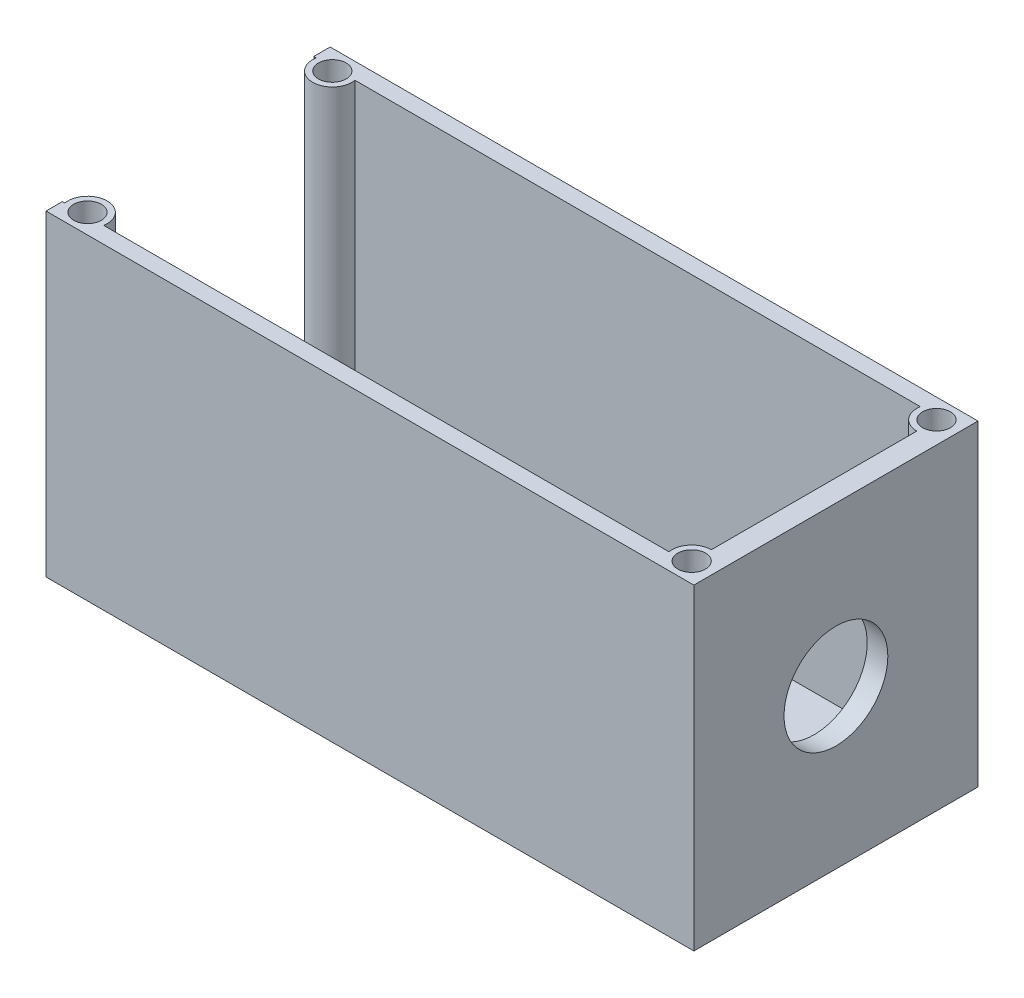
ISO-10303-21;
HEADER;
FILE_DESCRIPTION(('STEP AP214'),'2;1');
FILE_NAME('part.step','',(''),(''),'','','');
FILE_SCHEMA(('AUTOMOTIVE_DESIGN { 1 0 10303 214 1 1 1 1 }'));
ENDSEC;
DATA;
#1=APPLICATION_CONTEXT('core data for automotive mechanical design processes');
#2=APPLICATION_PROTOCOL_DEFINITION('international standard','automotive_design',2000,#1);
#3=PRODUCT_CONTEXT('',#1,'mechanical');
#4=PRODUCT('Part','Part','',(#3));
#5=PRODUCT_RELATED_PRODUCT_CATEGORY('part','',(#4));
#6=PRODUCT_DEFINITION_FORMATION('','',#4);
#7=PRODUCT_DEFINITION_CONTEXT('part definition',#1,'design');
#8=PRODUCT_DEFINITION('design','',#6,#7);
#9=PRODUCT_DEFINITION_SHAPE('','',#8);
#10=(LENGTH_UNIT() NAMED_UNIT(*) SI_UNIT(.MILLI.,.METRE.));
#11=(NAMED_UNIT(*) PLANE_ANGLE_UNIT() SI_UNIT($,.RADIAN.));
#12=(NAMED_UNIT(*) SI_UNIT($,.STERADIAN.) SOLID_ANGLE_UNIT());
#13=UNCERTAINTY_MEASURE_WITH_UNIT(LENGTH_MEASURE(1.E-05),#10,'distance_accuracy_value','');
#14=(GEOMETRIC_REPRESENTATION_CONTEXT(3) GLOBAL_UNCERTAINTY_ASSIGNED_CONTEXT((#13)) GLOBAL_UNIT_ASSIGNED_CONTEXT((#10,
#11,#12)) REPRESENTATION_CONTEXT('',''));
#15=CARTESIAN_POINT('',(0.,0.,0.));
#16=DIRECTION('',(0.,0.,1.));
#17=DIRECTION('',(1.,0.,0.));
#18=AXIS2_PLACEMENT_3D('',#15,#16,#17);
#19=CARTESIAN_POINT('',(57.28,-61.7251844873711,-24.5));
#20=DIRECTION('',(0.,0.,-1.));
#21=DIRECTION('',(-1.,0.,0.));
#22=AXIS2_PLACEMENT_3D('',#19,#20,#21);
#23=PLANE('',#22);
#24=DIRECTION('',(1.,0.,0.));
#25=VECTOR('',#24,1.);
#26=CARTESIAN_POINT('',(57.28,1.5,-24.5));
#27=LINE('',#26,#25);
#28=CARTESIAN_POINT('',(0.,1.5,-24.5));
#29=VERTEX_POINT('',#28);
#30=CARTESIAN_POINT('',(0.225176065070101,1.5,-24.5));
#31=VERTEX_POINT('',#30);
#32=EDGE_CURVE('E146',#29,#31,#27,.T.);
#33=ORIENTED_EDGE('',*,*,#32,.T.);
#34=DIRECTION('',(0.,1.,0.));
#35=VECTOR('',#34,1.);
#36=CARTESIAN_POINT('',(0.225176065070101,-3.59116882454314,-24.5));
#37=LINE('',#36,#35);
#38=CARTESIAN_POINT('',(0.225176065070101,29.,-24.5));
#39=VERTEX_POINT('',#38);
#40=EDGE_CURVE('E52',#31,#39,#37,.T.);
#41=ORIENTED_EDGE('',*,*,#40,.T.);
#42=DIRECTION('',(-1.,0.,0.));
#43=VECTOR('',#42,1.);
#44=CARTESIAN_POINT('',(57.28,29.,-24.5));
#45=LINE('',#44,#43);
#46=CARTESIAN_POINT('',(0.,29.,-24.5));
#47=VERTEX_POINT('',#46);
#48=EDGE_CURVE('E216',#39,#47,#45,.T.);
#49=ORIENTED_EDGE('',*,*,#48,.T.);
#50=DIRECTION('',(0.,1.,0.));
#51=VECTOR('',#50,1.);
#52=CARTESIAN_POINT('',(0.,-61.7251844873711,-24.5));
#53=LINE('',#52,#51);
#54=EDGE_CURVE('E222',#29,#47,#53,.T.);
#55=ORIENTED_EDGE('',*,*,#54,.F.);
#56=EDGE_LOOP('',(#33,#41,#49,#55));
#57=FACE_BOUND('',#56,.T.);
#58=ADVANCED_FACE('F37',(#57),#23,.F.);
#59=CARTESIAN_POINT('',(57.28,-61.7251844873711,-1.5));
#60=DIRECTION('',(0.,0.,1.));
#61=DIRECTION('',(1.,0.,0.));
#62=AXIS2_PLACEMENT_3D('',#59,#60,#61);
#63=PLANE('',#62);
#64=DIRECTION('',(0.,1.,0.));
#65=VECTOR('',#64,1.);
#66=CARTESIAN_POINT('',(3.77482393492987,-3.59116882454314,-1.5));
#67=LINE('',#66,#65);
#68=CARTESIAN_POINT('',(3.77482393492987,29.,-1.5));
#69=VERTEX_POINT('',#68);
#70=CARTESIAN_POINT('',(3.77482393492987,1.5,-1.5));
#71=VERTEX_POINT('',#70);
#72=EDGE_CURVE('E170',#69,#71,#67,.F.);
#73=ORIENTED_EDGE('',*,*,#72,.F.);
#74=DIRECTION('',(1.,0.,0.));
#75=VECTOR('',#74,1.);
#76=CARTESIAN_POINT('',(57.28,29.,-1.5));
#77=LINE('',#76,#75);
#78=CARTESIAN_POINT('',(55.5051760650701,29.,-1.5));
#79=VERTEX_POINT('',#78);
#80=EDGE_CURVE('E218',#69,#79,#77,.T.);
#81=ORIENTED_EDGE('',*,*,#80,.T.);
#82=DIRECTION('',(0.,1.,0.));
#83=VECTOR('',#82,1.);
#84=CARTESIAN_POINT('',(55.5051760650701,-3.59116882454314,-1.5));
#85=LINE('',#84,#83);
#86=CARTESIAN_POINT('',(55.5051760650701,1.5,-1.5));
#87=VERTEX_POINT('',#86);
#88=EDGE_CURVE('E193',#79,#87,#85,.F.);
#89=ORIENTED_EDGE('',*,*,#88,.T.);
#90=DIRECTION('',(-1.,0.,0.));
#91=VECTOR('',#90,1.);
#92=CARTESIAN_POINT('',(57.28,1.5,-1.5));
#93=LINE('',#92,#91);
#94=EDGE_CURVE('E210',#87,#71,#93,.T.);
#95=ORIENTED_EDGE('',*,*,#94,.T.);
#96=EDGE_LOOP('',(#73,#81,#89,#95));
#97=FACE_BOUND('',#96,.T.);
#98=ADVANCED_FACE('F269',(#97),#63,.F.);
#99=DIRECTION('',(0.,1.,0.));
#100=VECTOR('',#99,1.);
#101=CARTESIAN_POINT('',(0.225176065070103,-3.59116882454314,-1.49999999999999));
#102=LINE('',#101,#100);
#103=CARTESIAN_POINT('',(0.225176065070103,1.5,-1.49999999999999));
#104=VERTEX_POINT('',#103);
#105=CARTESIAN_POINT('',(0.225176065070103,29.,-1.49999999999999));
#106=VERTEX_POINT('',#105);
#107=EDGE_CURVE('E168',#104,#106,#102,.T.);
#108=ORIENTED_EDGE('',*,*,#107,.F.);
#109=CARTESIAN_POINT('',(0.,1.5,-1.49999999999999));
#110=VERTEX_POINT('',#109);
#111=EDGE_CURVE('E208',#104,#110,#93,.T.);
#112=ORIENTED_EDGE('',*,*,#111,.T.);
#113=DIRECTION('',(0.,1.,0.));
#114=VECTOR('',#113,1.);
#115=CARTESIAN_POINT('',(0.,-61.7251844873711,-1.49999999999999));
#116=LINE('',#115,#114);
#117=CARTESIAN_POINT('',(0.,29.,-1.49999999999999));
#118=VERTEX_POINT('',#117);
#119=EDGE_CURVE('E209',#110,#118,#116,.T.);
#120=ORIENTED_EDGE('',*,*,#119,.T.);
#121=EDGE_CURVE('E219',#118,#106,#77,.T.);
#122=ORIENTED_EDGE('',*,*,#121,.T.);
#123=EDGE_LOOP('',(#108,#112,#120,#122));
#124=FACE_BOUND('',#123,.T.);
#125=ADVANCED_FACE('F316',(#124),#63,.F.);
#126=CARTESIAN_POINT('',(57.28,-61.7251844873711,-1.5));
#127=DIRECTION('',(1.,0.,0.));
#128=DIRECTION('',(0.,0.,-1.));
#129=AXIS2_PLACEMENT_3D('',#126,#127,#128);
#130=PLANE('',#129);
#131=CARTESIAN_POINT('',(57.28,14.5,-13.));
#132=DIRECTION('',(-1.,0.,0.));
#133=DIRECTION('',(0.,0.,1.));
#134=AXIS2_PLACEMENT_3D('',#131,#132,#133);
#135=CIRCLE('',#134,4.8654);
#136=CARTESIAN_POINT('',(57.28,14.5,-8.1346));
#137=VERTEX_POINT('',#136);
#138=EDGE_CURVE('E201',#137,#137,#135,.T.);
#139=ORIENTED_EDGE('',*,*,#138,.F.);
#140=EDGE_LOOP('',(#139));
#141=FACE_BOUND('',#140,.T.);
#142=DIRECTION('',(0.,1.,0.));
#143=VECTOR('',#142,1.);
#144=CARTESIAN_POINT('',(57.28,-3.59116882454314,-22.4));
#145=LINE('',#144,#143);
#146=CARTESIAN_POINT('',(57.28,1.5,-22.4));
#147=VERTEX_POINT('',#146);
#148=CARTESIAN_POINT('',(57.28,29.,-22.4));
#149=VERTEX_POINT('',#148);
#150=EDGE_CURVE('E182',#147,#149,#145,.T.);
#151=ORIENTED_EDGE('',*,*,#150,.F.);
#152=DIRECTION('',(0.,0.,1.));
#153=VECTOR('',#152,1.);
#154=CARTESIAN_POINT('',(57.28,1.5,-1.5));
#155=LINE('',#154,#153);
#156=CARTESIAN_POINT('',(57.28,1.5,-3.6));
#157=VERTEX_POINT('',#156);
#158=EDGE_CURVE('E147',#147,#157,#155,.T.);
#159=ORIENTED_EDGE('',*,*,#158,.T.);
#160=DIRECTION('',(0.,1.,0.));
#161=VECTOR('',#160,1.);
#162=CARTESIAN_POINT('',(57.28,-3.59116882454314,-3.6));
#163=LINE('',#162,#161);
#164=CARTESIAN_POINT('',(57.28,29.,-3.6));
#165=VERTEX_POINT('',#164);
#166=EDGE_CURVE('E196',#157,#165,#163,.T.);
#167=ORIENTED_EDGE('',*,*,#166,.T.);
#168=DIRECTION('',(0.,0.,-1.));
#169=VECTOR('',#168,1.);
#170=CARTESIAN_POINT('',(57.28,29.,-1.5));
#171=LINE('',#170,#169);
#172=EDGE_CURVE('E204',#165,#149,#171,.T.);
#173=ORIENTED_EDGE('',*,*,#172,.T.);
#174=EDGE_LOOP('',(#151,#159,#167,#173));
#175=FACE_BOUND('',#174,.T.);
#176=ADVANCED_FACE('F278',(#141,#175),#130,.F.);
#177=CARTESIAN_POINT('',(55.5051760650701,29.,-24.5));
#178=VERTEX_POINT('',#177);
#179=CARTESIAN_POINT('',(3.77482393492987,29.,-24.5));
#180=VERTEX_POINT('',#179);
#181=EDGE_CURVE('E60',#178,#180,#45,.T.);
#182=ORIENTED_EDGE('',*,*,#181,.T.);
#183=DIRECTION('',(0.,1.,0.));
#184=VECTOR('',#183,1.);
#185=CARTESIAN_POINT('',(3.77482393492987,-3.59116882454314,-24.5));
#186=LINE('',#185,#184);
#187=CARTESIAN_POINT('',(3.77482393492987,1.5,-24.5));
#188=VERTEX_POINT('',#187);
#189=EDGE_CURVE('E149',#180,#188,#186,.F.);
#190=ORIENTED_EDGE('',*,*,#189,.T.);
#191=CARTESIAN_POINT('',(55.5051760650701,1.5,-24.5));
#192=VERTEX_POINT('',#191);
#193=EDGE_CURVE('E140',#188,#192,#27,.T.);
#194=ORIENTED_EDGE('',*,*,#193,.T.);
#195=DIRECTION('',(0.,1.,0.));
#196=VECTOR('',#195,1.);
#197=CARTESIAN_POINT('',(55.5051760650701,-3.59116882454314,-24.5));
#198=LINE('',#197,#196);
#199=EDGE_CURVE('E180',#178,#192,#198,.F.);
#200=ORIENTED_EDGE('',*,*,#199,.F.);
#201=EDGE_LOOP('',(#182,#190,#194,#200));
#202=FACE_BOUND('',#201,.T.);
#203=ADVANCED_FACE('F150',(#202),#23,.F.);
#204=CARTESIAN_POINT('',(0.,29.,0.));
#205=DIRECTION('',(0.,0.,-1.));
#206=DIRECTION('',(-1.,0.,0.));
#207=AXIS2_PLACEMENT_3D('',#204,#205,#206);
#208=PLANE('',#207);
#209=DIRECTION('',(0.,-1.,0.));
#210=VECTOR('',#209,1.);
#211=CARTESIAN_POINT('',(59.28,29.,0.));
#212=LINE('',#211,#210);
#213=CARTESIAN_POINT('',(59.28,29.,0.));
#214=VERTEX_POINT('',#213);
#215=CARTESIAN_POINT('',(59.28,0.,0.));
#216=VERTEX_POINT('',#215);
#217=EDGE_CURVE('E255',#214,#216,#212,.T.);
#218=ORIENTED_EDGE('',*,*,#217,.F.);
#219=DIRECTION('',(1.,0.,0.));
#220=VECTOR('',#219,1.);
#221=CARTESIAN_POINT('',(0.,29.,0.));
#222=LINE('',#221,#220);
#223=CARTESIAN_POINT('',(0.,29.,0.));
#224=VERTEX_POINT('',#223);
#225=EDGE_CURVE('E227',#224,#214,#222,.T.);
#226=ORIENTED_EDGE('',*,*,#225,.F.);
#227=DIRECTION('',(0.,-1.,0.));
#228=VECTOR('',#227,1.);
#229=CARTESIAN_POINT('',(0.,29.,0.));
#230=LINE('',#229,#228);
#231=CARTESIAN_POINT('',(0.,0.,0.));
#232=VERTEX_POINT('',#231);
#233=EDGE_CURVE('E239',#224,#232,#230,.T.);
#234=ORIENTED_EDGE('',*,*,#233,.T.);
#235=DIRECTION('',(1.,0.,0.));
#236=VECTOR('',#235,1.);
#237=CARTESIAN_POINT('',(0.,0.,0.));
#238=LINE('',#237,#236);
#239=EDGE_CURVE('E226',#232,#216,#238,.T.);
#240=ORIENTED_EDGE('',*,*,#239,.T.);
#241=EDGE_LOOP('',(#218,#226,#234,#240));
#242=FACE_BOUND('',#241,.T.);
#243=ADVANCED_FACE('F39',(#242),#208,.F.);
#244=CARTESIAN_POINT('',(59.28,29.,0.));
#245=DIRECTION('',(-1.,0.,0.));
#246=DIRECTION('',(0.,0.,1.));
#247=AXIS2_PLACEMENT_3D('',#244,#245,#246);
#248=PLANE('',#247);
#249=CARTESIAN_POINT('',(59.28,14.5,-13.));
#250=DIRECTION('',(1.,0.,0.));
#251=DIRECTION('',(0.,0.,-1.));
#252=AXIS2_PLACEMENT_3D('',#249,#250,#251);
#253=CIRCLE('',#252,4.75);
#254=CARTESIAN_POINT('',(59.28,14.5,-17.75));
#255=VERTEX_POINT('',#254);
#256=EDGE_CURVE('E198',#255,#255,#253,.T.);
#257=ORIENTED_EDGE('',*,*,#256,.F.);
#258=EDGE_LOOP('',(#257));
#259=FACE_BOUND('',#258,.T.);
#260=DIRECTION('',(0.,0.,-1.));
#261=VECTOR('',#260,1.);
#262=CARTESIAN_POINT('',(59.28,0.,0.));
#263=LINE('',#262,#261);
#264=CARTESIAN_POINT('',(59.28,0.,-26.));
#265=VERTEX_POINT('',#264);
#266=EDGE_CURVE('E242',#216,#265,#263,.T.);
#267=ORIENTED_EDGE('',*,*,#266,.T.);
#268=DIRECTION('',(0.,-1.,0.));
#269=VECTOR('',#268,1.);
#270=CARTESIAN_POINT('',(59.28,29.,-26.));
#271=LINE('',#270,#269);
#272=CARTESIAN_POINT('',(59.28,29.,-26.));
#273=VERTEX_POINT('',#272);
#274=EDGE_CURVE('E253',#273,#265,#271,.T.);
#275=ORIENTED_EDGE('',*,*,#274,.F.);
#276=DIRECTION('',(0.,0.,-1.));
#277=VECTOR('',#276,1.);
#278=CARTESIAN_POINT('',(59.28,29.,0.));
#279=LINE('',#278,#277);
#280=EDGE_CURVE('E229',#214,#273,#279,.T.);
#281=ORIENTED_EDGE('',*,*,#280,.F.);
#282=ORIENTED_EDGE('',*,*,#217,.T.);
#283=EDGE_LOOP('',(#267,#275,#281,#282));
#284=FACE_BOUND('',#283,.T.);
#285=ADVANCED_FACE('F323',(#259,#284),#248,.F.);
#286=CARTESIAN_POINT('',(0.,29.,-26.));
#287=DIRECTION('',(0.,0.,-1.));
#288=DIRECTION('',(-1.,0.,0.));
#289=AXIS2_PLACEMENT_3D('',#286,#287,#288);
#290=PLANE('',#289);
#291=DIRECTION('',(1.,0.,0.));
#292=VECTOR('',#291,1.);
#293=CARTESIAN_POINT('',(0.,29.,-26.));
#294=LINE('',#293,#292);
#295=CARTESIAN_POINT('',(0.,29.,-26.));
#296=VERTEX_POINT('',#295);
#297=EDGE_CURVE('E233',#296,#273,#294,.T.);
#298=ORIENTED_EDGE('',*,*,#297,.T.);
#299=ORIENTED_EDGE('',*,*,#274,.T.);
#300=DIRECTION('',(1.,0.,0.));
#301=VECTOR('',#300,1.);
#302=CARTESIAN_POINT('',(0.,0.,-26.));
#303=LINE('',#302,#301);
#304=CARTESIAN_POINT('',(0.,0.,-26.));
#305=VERTEX_POINT('',#304);
#306=EDGE_CURVE('E245',#305,#265,#303,.T.);
#307=ORIENTED_EDGE('',*,*,#306,.F.);
#308=DIRECTION('',(0.,-1.,0.));
#309=VECTOR('',#308,1.);
#310=CARTESIAN_POINT('',(0.,29.,-26.));
#311=LINE('',#310,#309);
#312=EDGE_CURVE('E251',#296,#305,#311,.T.);
#313=ORIENTED_EDGE('',*,*,#312,.F.);
#314=EDGE_LOOP('',(#298,#299,#307,#313));
#315=FACE_BOUND('',#314,.T.);
#316=ADVANCED_FACE('F307',(#315),#290,.T.);
#317=CARTESIAN_POINT('',(0.,29.,0.));
#318=DIRECTION('',(-1.,0.,0.));
#319=DIRECTION('',(0.,0.,1.));
#320=AXIS2_PLACEMENT_3D('',#317,#318,#319);
#321=PLANE('',#320);
#322=ORIENTED_EDGE('',*,*,#119,.F.);
#323=DIRECTION('',(0.,0.,-1.));
#324=VECTOR('',#323,1.);
#325=CARTESIAN_POINT('',(0.,1.5,-1.49999999999999));
#326=LINE('',#325,#324);
#327=EDGE_CURVE('E205',#110,#29,#326,.T.);
#328=ORIENTED_EDGE('',*,*,#327,.T.);
#329=ORIENTED_EDGE('',*,*,#54,.T.);
#330=DIRECTION('',(0.,0.,-1.));
#331=VECTOR('',#330,1.);
#332=CARTESIAN_POINT('',(0.,29.,0.));
#333=LINE('',#332,#331);
#334=EDGE_CURVE('E235',#47,#296,#333,.T.);
#335=ORIENTED_EDGE('',*,*,#334,.T.);
#336=ORIENTED_EDGE('',*,*,#312,.T.);
#337=DIRECTION('',(0.,0.,-1.));
#338=VECTOR('',#337,1.);
#339=CARTESIAN_POINT('',(0.,0.,0.));
#340=LINE('',#339,#338);
#341=EDGE_CURVE('E230',#232,#305,#340,.T.);
#342=ORIENTED_EDGE('',*,*,#341,.F.);
#343=ORIENTED_EDGE('',*,*,#233,.F.);
#344=EDGE_CURVE('E236',#224,#118,#333,.T.);
#345=ORIENTED_EDGE('',*,*,#344,.T.);
#346=EDGE_LOOP('',(#322,#328,#329,#335,#336,#342,#343,#345));
#347=FACE_BOUND('',#346,.T.);
#348=ADVANCED_FACE('F299',(#347),#321,.T.);
#349=CARTESIAN_POINT('',(0.,29.,0.));
#350=DIRECTION('',(0.,1.,0.));
#351=DIRECTION('',(0.,0.,1.));
#352=AXIS2_PLACEMENT_3D('',#349,#350,#351);
#353=PLANE('',#352);
#354=CARTESIAN_POINT('',(1.99999999999999,29.,-24.2));
#355=DIRECTION('',(0.,1.,0.));
#356=DIRECTION('',(0.,0.,1.));
#357=AXIS2_PLACEMENT_3D('',#354,#355,#356);
#358=CIRCLE('',#357,1.26999999999999);
#359=CARTESIAN_POINT('',(1.99999999999999,29.,-22.93));
#360=VERTEX_POINT('',#359);
#361=EDGE_CURVE('E289',#360,#360,#358,.T.);
#362=ORIENTED_EDGE('',*,*,#361,.F.);
#363=EDGE_LOOP('',(#362));
#364=FACE_BOUND('',#363,.T.);
#365=ORIENTED_EDGE('',*,*,#48,.F.);
#366=CARTESIAN_POINT('',(1.99999999999999,29.,-24.2));
#367=DIRECTION('',(0.,1.,0.));
#368=DIRECTION('',(0.,0.,-1.));
#369=AXIS2_PLACEMENT_3D('',#366,#367,#368);
#370=CIRCLE('',#369,1.8);
#371=EDGE_CURVE('E154',#39,#180,#370,.T.);
#372=ORIENTED_EDGE('',*,*,#371,.T.);
#373=ORIENTED_EDGE('',*,*,#181,.F.);
#374=CARTESIAN_POINT('',(57.28,29.,-24.2));
#375=DIRECTION('',(0.,-1.,0.));
#376=DIRECTION('',(0.,0.,-1.));
#377=AXIS2_PLACEMENT_3D('',#374,#375,#376);
#378=CIRCLE('',#377,1.8);
#379=EDGE_CURVE('E178',#149,#178,#378,.T.);
#380=ORIENTED_EDGE('',*,*,#379,.F.);
#381=ORIENTED_EDGE('',*,*,#172,.F.);
#382=CARTESIAN_POINT('',(57.28,29.,-1.8));
#383=DIRECTION('',(0.,1.,0.));
#384=DIRECTION('',(0.,0.,1.));
#385=AXIS2_PLACEMENT_3D('',#382,#383,#384);
#386=CIRCLE('',#385,1.8);
#387=EDGE_CURVE('E190',#165,#79,#386,.T.);
#388=ORIENTED_EDGE('',*,*,#387,.T.);
#389=ORIENTED_EDGE('',*,*,#80,.F.);
#390=CARTESIAN_POINT('',(1.99999999999999,29.,-1.8));
#391=DIRECTION('',(0.,-1.,0.));
#392=DIRECTION('',(0.,0.,1.));
#393=AXIS2_PLACEMENT_3D('',#390,#391,#392);
#394=CIRCLE('',#393,1.8);
#395=EDGE_CURVE('E166',#106,#69,#394,.T.);
#396=ORIENTED_EDGE('',*,*,#395,.F.);
#397=ORIENTED_EDGE('',*,*,#121,.F.);
#398=ORIENTED_EDGE('',*,*,#344,.F.);
#399=ORIENTED_EDGE('',*,*,#225,.T.);
#400=ORIENTED_EDGE('',*,*,#280,.T.);
#401=ORIENTED_EDGE('',*,*,#297,.F.);
#402=ORIENTED_EDGE('',*,*,#334,.F.);
#403=EDGE_LOOP('',(#365,#372,#373,#380,#381,#388,#389,#396,#397,#398,#399,#400,#401,#402));
#404=FACE_BOUND('',#403,.T.);
#405=CARTESIAN_POINT('',(1.99999999999999,29.,-1.8));
#406=DIRECTION('',(0.,1.,0.));
#407=DIRECTION('',(0.,0.,1.));
#408=AXIS2_PLACEMENT_3D('',#405,#406,#407);
#409=CIRCLE('',#408,1.26999999999999);
#410=CARTESIAN_POINT('',(1.99999999999999,29.,-0.53000000000001));
#411=VERTEX_POINT('',#410);
#412=EDGE_CURVE('E157',#411,#411,#409,.T.);
#413=ORIENTED_EDGE('',*,*,#412,.F.);
#414=EDGE_LOOP('',(#413));
#415=FACE_BOUND('',#414,.T.);
#416=CARTESIAN_POINT('',(57.28,29.,-24.2));
#417=DIRECTION('',(0.,1.,0.));
#418=DIRECTION('',(0.,0.,1.));
#419=AXIS2_PLACEMENT_3D('',#416,#417,#418);
#420=CIRCLE('',#419,1.26999999999999);
#421=CARTESIAN_POINT('',(57.28,29.,-22.93));
#422=VERTEX_POINT('',#421);
#423=EDGE_CURVE('E172',#422,#422,#420,.T.);
#424=ORIENTED_EDGE('',*,*,#423,.F.);
#425=EDGE_LOOP('',(#424));
#426=FACE_BOUND('',#425,.T.);
#427=CARTESIAN_POINT('',(57.28,29.,-1.8));
#428=DIRECTION('',(0.,1.,0.));
#429=DIRECTION('',(0.,0.,1.));
#430=AXIS2_PLACEMENT_3D('',#427,#428,#429);
#431=CIRCLE('',#430,1.26999999999999);
#432=CARTESIAN_POINT('',(57.28,29.,-0.530000000000014));
#433=VERTEX_POINT('',#432);
#434=EDGE_CURVE('E184',#433,#433,#431,.T.);
#435=ORIENTED_EDGE('',*,*,#434,.F.);
#436=EDGE_LOOP('',(#435));
#437=FACE_BOUND('',#436,.T.);
#438=ADVANCED_FACE('F284',(#364,#404,#415,#426,#437),#353,.T.);
#439=CARTESIAN_POINT('',(0.,0.,0.));
#440=DIRECTION('',(0.,1.,0.));
#441=DIRECTION('',(0.,0.,1.));
#442=AXIS2_PLACEMENT_3D('',#439,#440,#441);
#443=PLANE('',#442);
#444=ORIENTED_EDGE('',*,*,#239,.F.);
#445=ORIENTED_EDGE('',*,*,#341,.T.);
#446=ORIENTED_EDGE('',*,*,#306,.T.);
#447=ORIENTED_EDGE('',*,*,#266,.F.);
#448=EDGE_LOOP('',(#444,#445,#446,#447));
#449=FACE_BOUND('',#448,.T.);
#450=ADVANCED_FACE('F298',(#449),#443,.F.);
#451=CARTESIAN_POINT('',(0.,1.5,0.));
#452=DIRECTION('',(0.,1.,0.));
#453=DIRECTION('',(0.,0.,1.));
#454=AXIS2_PLACEMENT_3D('',#451,#452,#453);
#455=PLANE('',#454);
#456=CARTESIAN_POINT('',(1.99999999999999,1.5,-24.2));
#457=DIRECTION('',(0.,1.,0.));
#458=DIRECTION('',(0.,0.,1.));
#459=AXIS2_PLACEMENT_3D('',#456,#457,#458);
#460=CIRCLE('',#459,1.8);
#461=EDGE_CURVE('E13',#31,#188,#460,.T.);
#462=ORIENTED_EDGE('',*,*,#461,.F.);
#463=ORIENTED_EDGE('',*,*,#32,.F.);
#464=ORIENTED_EDGE('',*,*,#327,.F.);
#465=ORIENTED_EDGE('',*,*,#111,.F.);
#466=CARTESIAN_POINT('',(1.99999999999999,1.5,-1.8));
#467=DIRECTION('',(0.,1.,0.));
#468=DIRECTION('',(0.,0.,1.));
#469=AXIS2_PLACEMENT_3D('',#466,#467,#468);
#470=CIRCLE('',#469,1.8);
#471=EDGE_CURVE('E45',#104,#71,#470,.F.);
#472=ORIENTED_EDGE('',*,*,#471,.T.);
#473=ORIENTED_EDGE('',*,*,#94,.F.);
#474=CARTESIAN_POINT('',(57.28,1.5,-1.8));
#475=DIRECTION('',(0.,1.,0.));
#476=DIRECTION('',(0.,0.,1.));
#477=AXIS2_PLACEMENT_3D('',#474,#475,#476);
#478=CIRCLE('',#477,1.8);
#479=EDGE_CURVE('E258',#157,#87,#478,.T.);
#480=ORIENTED_EDGE('',*,*,#479,.F.);
#481=ORIENTED_EDGE('',*,*,#158,.F.);
#482=CARTESIAN_POINT('',(57.28,1.5,-24.2));
#483=DIRECTION('',(0.,1.,0.));
#484=DIRECTION('',(0.,0.,1.));
#485=AXIS2_PLACEMENT_3D('',#482,#483,#484);
#486=CIRCLE('',#485,1.8);
#487=EDGE_CURVE('E144',#147,#192,#486,.F.);
#488=ORIENTED_EDGE('',*,*,#487,.T.);
#489=ORIENTED_EDGE('',*,*,#193,.F.);
#490=EDGE_LOOP('',(#462,#463,#464,#465,#472,#473,#480,#481,#488,#489));
#491=FACE_BOUND('',#490,.T.);
#492=ADVANCED_FACE('F141',(#491),#455,.T.);
#493=CARTESIAN_POINT('',(59.28,14.5,-13.));
#494=DIRECTION('',(-1.,0.,0.));
#495=DIRECTION('',(0.,0.,1.));
#496=AXIS2_PLACEMENT_3D('',#493,#494,#495);
#497=CONICAL_SURFACE('',#496,4.75,0.0576360942636149);
#498=ORIENTED_EDGE('',*,*,#256,.T.);
#499=EDGE_LOOP('',(#498));
#500=FACE_BOUND('',#499,.T.);
#501=ORIENTED_EDGE('',*,*,#138,.T.);
#502=EDGE_LOOP('',(#501));
#503=FACE_BOUND('',#502,.T.);
#504=ADVANCED_FACE('F332',(#500,#503),#497,.F.);
#505=CARTESIAN_POINT('',(57.28,-3.59116882454314,-1.8));
#506=DIRECTION('',(0.,1.,0.));
#507=DIRECTION('',(0.,0.,1.));
#508=AXIS2_PLACEMENT_3D('',#505,#506,#507);
#509=CYLINDRICAL_SURFACE('',#508,1.8);
#510=ORIENTED_EDGE('',*,*,#166,.F.);
#511=ORIENTED_EDGE('',*,*,#479,.T.);
#512=ORIENTED_EDGE('',*,*,#88,.F.);
#513=ORIENTED_EDGE('',*,*,#387,.F.);
#514=EDGE_LOOP('',(#510,#511,#512,#513));
#515=FACE_BOUND('',#514,.T.);
#516=ADVANCED_FACE('F275',(#515),#509,.T.);
#517=CARTESIAN_POINT('',(57.28,19.,-1.8));
#518=DIRECTION('',(0.,-1.,0.));
#519=DIRECTION('',(0.,0.,-1.));
#520=AXIS2_PLACEMENT_3D('',#517,#518,#519);
#521=PLANE('',#520);
#522=CARTESIAN_POINT('',(57.28,19.,-1.8));
#523=DIRECTION('',(0.,1.,0.));
#524=DIRECTION('',(0.,0.,1.));
#525=AXIS2_PLACEMENT_3D('',#522,#523,#524);
#526=CIRCLE('',#525,1.26999999999999);
#527=CARTESIAN_POINT('',(57.28,19.,-0.530000000000014));
#528=VERTEX_POINT('',#527);
#529=EDGE_CURVE('E187',#528,#528,#526,.T.);
#530=ORIENTED_EDGE('',*,*,#529,.T.);
#531=EDGE_LOOP('',(#530));
#532=FACE_BOUND('',#531,.T.);
#533=ADVANCED_FACE('F340',(#532),#521,.F.);
#534=CARTESIAN_POINT('',(57.28,29.,-1.8));
#535=DIRECTION('',(0.,1.,0.));
#536=DIRECTION('',(0.,0.,1.));
#537=AXIS2_PLACEMENT_3D('',#534,#535,#536);
#538=CYLINDRICAL_SURFACE('',#537,1.26999999999999);
#539=ORIENTED_EDGE('',*,*,#529,.F.);
#540=EDGE_LOOP('',(#539));
#541=FACE_BOUND('',#540,.T.);
#542=ORIENTED_EDGE('',*,*,#434,.T.);
#543=EDGE_LOOP('',(#542));
#544=FACE_BOUND('',#543,.T.);
#545=ADVANCED_FACE('F346',(#541,#544),#538,.F.);
#546=CARTESIAN_POINT('',(57.28,-3.59116882454314,-24.2));
#547=DIRECTION('',(0.,1.,0.));
#548=DIRECTION('',(0.,0.,1.));
#549=AXIS2_PLACEMENT_3D('',#546,#547,#548);
#550=CYLINDRICAL_SURFACE('',#549,1.8);
#551=ORIENTED_EDGE('',*,*,#487,.F.);
#552=ORIENTED_EDGE('',*,*,#150,.T.);
#553=ORIENTED_EDGE('',*,*,#379,.T.);
#554=ORIENTED_EDGE('',*,*,#199,.T.);
#555=EDGE_LOOP('',(#551,#552,#553,#554));
#556=FACE_BOUND('',#555,.T.);
#557=ADVANCED_FACE('F282',(#556),#550,.T.);
#558=CARTESIAN_POINT('',(57.28,19.,-24.2));
#559=DIRECTION('',(0.,-1.,0.));
#560=DIRECTION('',(0.,0.,-1.));
#561=AXIS2_PLACEMENT_3D('',#558,#559,#560);
#562=PLANE('',#561);
#563=CARTESIAN_POINT('',(57.28,19.,-24.2));
#564=DIRECTION('',(0.,1.,0.));
#565=DIRECTION('',(0.,0.,1.));
#566=AXIS2_PLACEMENT_3D('',#563,#564,#565);
#567=CIRCLE('',#566,1.26999999999999);
#568=CARTESIAN_POINT('',(57.28,19.,-22.93));
#569=VERTEX_POINT('',#568);
#570=EDGE_CURVE('E175',#569,#569,#567,.T.);
#571=ORIENTED_EDGE('',*,*,#570,.T.);
#572=EDGE_LOOP('',(#571));
#573=FACE_BOUND('',#572,.T.);
#574=ADVANCED_FACE('F353',(#573),#562,.F.);
#575=CARTESIAN_POINT('',(57.28,29.,-24.2));
#576=DIRECTION('',(0.,1.,0.));
#577=DIRECTION('',(0.,0.,1.));
#578=AXIS2_PLACEMENT_3D('',#575,#576,#577);
#579=CYLINDRICAL_SURFACE('',#578,1.26999999999999);
#580=ORIENTED_EDGE('',*,*,#570,.F.);
#581=EDGE_LOOP('',(#580));
#582=FACE_BOUND('',#581,.T.);
#583=ORIENTED_EDGE('',*,*,#423,.T.);
#584=EDGE_LOOP('',(#583));
#585=FACE_BOUND('',#584,.T.);
#586=ADVANCED_FACE('F356',(#582,#585),#579,.F.);
#587=CARTESIAN_POINT('',(1.99999999999999,-3.59116882454314,-1.8));
#588=DIRECTION('',(0.,1.,0.));
#589=DIRECTION('',(0.,0.,1.));
#590=AXIS2_PLACEMENT_3D('',#587,#588,#589);
#591=CYLINDRICAL_SURFACE('',#590,1.8);
#592=ORIENTED_EDGE('',*,*,#395,.T.);
#593=ORIENTED_EDGE('',*,*,#72,.T.);
#594=ORIENTED_EDGE('',*,*,#471,.F.);
#595=ORIENTED_EDGE('',*,*,#107,.T.);
#596=EDGE_LOOP('',(#592,#593,#594,#595));
#597=FACE_BOUND('',#596,.T.);
#598=ADVANCED_FACE('F360',(#597),#591,.T.);
#599=CARTESIAN_POINT('',(1.99999999999999,19.,-1.8));
#600=DIRECTION('',(0.,-1.,0.));
#601=DIRECTION('',(0.,0.,-1.));
#602=AXIS2_PLACEMENT_3D('',#599,#600,#601);
#603=PLANE('',#602);
#604=CARTESIAN_POINT('',(1.99999999999999,19.,-1.8));
#605=DIRECTION('',(0.,1.,0.));
#606=DIRECTION('',(0.,0.,1.));
#607=AXIS2_PLACEMENT_3D('',#604,#605,#606);
#608=CIRCLE('',#607,1.26999999999999);
#609=CARTESIAN_POINT('',(1.99999999999999,19.,-0.530000000000012));
#610=VERTEX_POINT('',#609);
#611=EDGE_CURVE('E160',#610,#610,#608,.T.);
#612=ORIENTED_EDGE('',*,*,#611,.T.);
#613=EDGE_LOOP('',(#612));
#614=FACE_BOUND('',#613,.T.);
#615=ADVANCED_FACE('F364',(#614),#603,.F.);
#616=CARTESIAN_POINT('',(1.99999999999999,29.,-1.8));
#617=DIRECTION('',(0.,1.,0.));
#618=DIRECTION('',(0.,0.,1.));
#619=AXIS2_PLACEMENT_3D('',#616,#617,#618);
#620=CYLINDRICAL_SURFACE('',#619,1.26999999999999);
#621=ORIENTED_EDGE('',*,*,#611,.F.);
#622=EDGE_LOOP('',(#621));
#623=FACE_BOUND('',#622,.T.);
#624=ORIENTED_EDGE('',*,*,#412,.T.);
#625=EDGE_LOOP('',(#624));
#626=FACE_BOUND('',#625,.T.);
#627=ADVANCED_FACE('F367',(#623,#626),#620,.F.);
#628=CARTESIAN_POINT('',(1.99999999999999,-3.59116882454314,-24.2));
#629=DIRECTION('',(0.,1.,0.));
#630=DIRECTION('',(0.,0.,1.));
#631=AXIS2_PLACEMENT_3D('',#628,#629,#630);
#632=CYLINDRICAL_SURFACE('',#631,1.8);
#633=ORIENTED_EDGE('',*,*,#40,.F.);
#634=ORIENTED_EDGE('',*,*,#461,.T.);
#635=ORIENTED_EDGE('',*,*,#189,.F.);
#636=ORIENTED_EDGE('',*,*,#371,.F.);
#637=EDGE_LOOP('',(#633,#634,#635,#636));
#638=FACE_BOUND('',#637,.T.);
#639=ADVANCED_FACE('F156',(#638),#632,.T.);
#640=CARTESIAN_POINT('',(1.99999999999999,19.,-24.2));
#641=DIRECTION('',(0.,-1.,0.));
#642=DIRECTION('',(0.,0.,-1.));
#643=AXIS2_PLACEMENT_3D('',#640,#641,#642);
#644=PLANE('',#643);
#645=CARTESIAN_POINT('',(1.99999999999999,19.,-24.2));
#646=DIRECTION('',(0.,1.,0.));
#647=DIRECTION('',(0.,0.,1.));
#648=AXIS2_PLACEMENT_3D('',#645,#646,#647);
#649=CIRCLE('',#648,1.26999999999999);
#650=CARTESIAN_POINT('',(1.99999999999999,19.,-22.93));
#651=VERTEX_POINT('',#650);
#652=EDGE_CURVE('E287',#651,#651,#649,.T.);
#653=ORIENTED_EDGE('',*,*,#652,.T.);
#654=EDGE_LOOP('',(#653));
#655=FACE_BOUND('',#654,.T.);
#656=ADVANCED_FACE('F374',(#655),#644,.F.);
#657=CARTESIAN_POINT('',(1.99999999999999,29.,-24.2));
#658=DIRECTION('',(0.,1.,0.));
#659=DIRECTION('',(0.,0.,1.));
#660=AXIS2_PLACEMENT_3D('',#657,#658,#659);
#661=CYLINDRICAL_SURFACE('',#660,1.26999999999999);
#662=ORIENTED_EDGE('',*,*,#652,.F.);
#663=EDGE_LOOP('',(#662));
#664=FACE_BOUND('',#663,.T.);
#665=ORIENTED_EDGE('',*,*,#361,.T.);
#666=EDGE_LOOP('',(#665));
#667=FACE_BOUND('',#666,.T.);
#668=ADVANCED_FACE('F295',(#664,#667),#661,.F.);
#669=CLOSED_SHELL('',(#58,#98,#125,#176,#203,#243,#285,#316,#348,#438,#450,#492,#504,#516,#533,
#545,#557,#574,#586,#598,#615,#627,#639,#656,#668));
#670=MANIFOLD_SOLID_BREP('B2',#669);
#671=ADVANCED_BREP_SHAPE_REPRESENTATION('',(#18,#670),#14);
#672=SHAPE_DEFINITION_REPRESENTATION(#9,#671);
ENDSEC;
END-ISO-10303-21;
